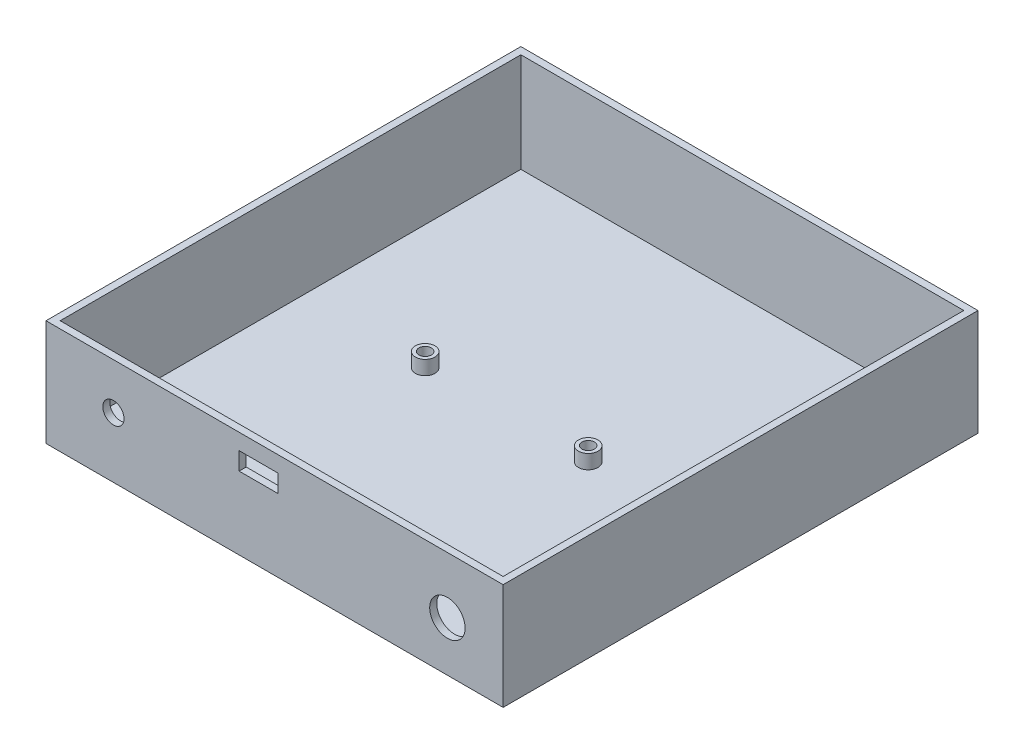
ISO-10303-21;
HEADER;
FILE_DESCRIPTION(('STEP AP214'),'2;1');
FILE_NAME('part.step','',(''),(''),'','','');
FILE_SCHEMA(('AUTOMOTIVE_DESIGN { 1 0 10303 214 1 1 1 1 }'));
ENDSEC;
DATA;
#1=APPLICATION_CONTEXT('core data for automotive mechanical design processes');
#2=APPLICATION_PROTOCOL_DEFINITION('international standard','automotive_design',2000,#1);
#3=PRODUCT_CONTEXT('',#1,'mechanical');
#4=PRODUCT('Part','Part','',(#3));
#5=PRODUCT_RELATED_PRODUCT_CATEGORY('part','',(#4));
#6=PRODUCT_DEFINITION_FORMATION('','',#4);
#7=PRODUCT_DEFINITION_CONTEXT('part definition',#1,'design');
#8=PRODUCT_DEFINITION('design','',#6,#7);
#9=PRODUCT_DEFINITION_SHAPE('','',#8);
#10=(LENGTH_UNIT() NAMED_UNIT(*) SI_UNIT(.MILLI.,.METRE.));
#11=(NAMED_UNIT(*) PLANE_ANGLE_UNIT() SI_UNIT($,.RADIAN.));
#12=(NAMED_UNIT(*) SI_UNIT($,.STERADIAN.) SOLID_ANGLE_UNIT());
#13=UNCERTAINTY_MEASURE_WITH_UNIT(LENGTH_MEASURE(1.E-05),#10,'distance_accuracy_value','');
#14=(GEOMETRIC_REPRESENTATION_CONTEXT(3) GLOBAL_UNCERTAINTY_ASSIGNED_CONTEXT((#13)) GLOBAL_UNIT_ASSIGNED_CONTEXT((#10,
#11,#12)) REPRESENTATION_CONTEXT('',''));
#15=CARTESIAN_POINT('',(0.,0.,0.));
#16=DIRECTION('',(0.,0.,1.));
#17=DIRECTION('',(1.,0.,0.));
#18=AXIS2_PLACEMENT_3D('',#15,#16,#17);
#19=CARTESIAN_POINT('',(125.,30.,0.));
#20=DIRECTION('',(0.,0.,1.));
#21=DIRECTION('',(1.,0.,0.));
#22=AXIS2_PLACEMENT_3D('',#19,#20,#21);
#23=PLANE('',#22);
#24=CARTESIAN_POINT('',(17.0245167625875,17.0325814726198,0.));
#25=DIRECTION('',(0.,0.,-1.));
#26=DIRECTION('',(-1.,0.,0.));
#27=AXIS2_PLACEMENT_3D('',#24,#25,#26);
#28=CIRCLE('',#27,3.);
#29=CARTESIAN_POINT('',(14.0245167625875,17.0325814726198,0.));
#30=VERTEX_POINT('',#29);
#31=EDGE_CURVE('E307',#30,#30,#28,.T.);
#32=ORIENTED_EDGE('',*,*,#31,.F.);
#33=EDGE_LOOP('',(#32));
#34=FACE_BOUND('',#33,.T.);
#35=CARTESIAN_POINT('',(111.272952746564,14.0325814726198,0.));
#36=DIRECTION('',(0.,0.,-1.));
#37=DIRECTION('',(-1.,0.,0.));
#38=AXIS2_PLACEMENT_3D('',#35,#36,#37);
#39=CIRCLE('',#38,5.);
#40=CARTESIAN_POINT('',(106.272952746564,14.0325814726198,0.));
#41=VERTEX_POINT('',#40);
#42=EDGE_CURVE('E312',#41,#41,#39,.T.);
#43=ORIENTED_EDGE('',*,*,#42,.F.);
#44=EDGE_LOOP('',(#43));
#45=FACE_BOUND('',#44,.T.);
#46=DIRECTION('',(0.,-1.,0.));
#47=VECTOR('',#46,1.);
#48=CARTESIAN_POINT('',(63.5,25.5,0.));
#49=LINE('',#48,#47);
#50=CARTESIAN_POINT('',(63.5,25.5,0.));
#51=VERTEX_POINT('',#50);
#52=CARTESIAN_POINT('',(63.5,20.5,0.));
#53=VERTEX_POINT('',#52);
#54=EDGE_CURVE('E51',#51,#53,#49,.T.);
#55=ORIENTED_EDGE('',*,*,#54,.F.);
#56=DIRECTION('',(-1.,0.,0.));
#57=VECTOR('',#56,1.);
#58=CARTESIAN_POINT('',(52.5,25.5,0.));
#59=LINE('',#58,#57);
#60=CARTESIAN_POINT('',(52.5,25.5,0.));
#61=VERTEX_POINT('',#60);
#62=EDGE_CURVE('E320',#51,#61,#59,.T.);
#63=ORIENTED_EDGE('',*,*,#62,.T.);
#64=DIRECTION('',(0.,-1.,0.));
#65=VECTOR('',#64,1.);
#66=CARTESIAN_POINT('',(52.5,25.5,0.));
#67=LINE('',#66,#65);
#68=CARTESIAN_POINT('',(52.5,20.5,0.));
#69=VERTEX_POINT('',#68);
#70=EDGE_CURVE('E167',#61,#69,#67,.T.);
#71=ORIENTED_EDGE('',*,*,#70,.T.);
#72=DIRECTION('',(-1.,0.,0.));
#73=VECTOR('',#72,1.);
#74=CARTESIAN_POINT('',(52.5,20.5,0.));
#75=LINE('',#74,#73);
#76=EDGE_CURVE('E168',#53,#69,#75,.T.);
#77=ORIENTED_EDGE('',*,*,#76,.F.);
#78=EDGE_LOOP('',(#55,#63,#71,#77));
#79=FACE_BOUND('',#78,.T.);
#80=DIRECTION('',(0.,-1.,0.));
#81=VECTOR('',#80,1.);
#82=CARTESIAN_POINT('',(33.1125413911823,6.,0.));
#83=LINE('',#82,#81);
#84=CARTESIAN_POINT('',(33.1125413911823,2.,0.));
#85=VERTEX_POINT('',#84);
#86=CARTESIAN_POINT('',(33.1125413911823,6.,0.));
#87=VERTEX_POINT('',#86);
#88=EDGE_CURVE('E208',#85,#87,#83,.F.);
#89=ORIENTED_EDGE('',*,*,#88,.F.);
#90=DIRECTION('',(1.,0.,0.));
#91=VECTOR('',#90,1.);
#92=CARTESIAN_POINT('',(0.,2.,0.));
#93=LINE('',#92,#91);
#94=CARTESIAN_POINT('',(0.,2.,0.));
#95=VERTEX_POINT('',#94);
#96=EDGE_CURVE('E281',#95,#85,#93,.T.);
#97=ORIENTED_EDGE('',*,*,#96,.F.);
#98=DIRECTION('',(0.,-1.,0.));
#99=VECTOR('',#98,1.);
#100=CARTESIAN_POINT('',(0.,30.,0.));
#101=LINE('',#100,#99);
#102=CARTESIAN_POINT('',(0.,30.,0.));
#103=VERTEX_POINT('',#102);
#104=EDGE_CURVE('E234',#103,#95,#101,.T.);
#105=ORIENTED_EDGE('',*,*,#104,.F.);
#106=DIRECTION('',(-1.,0.,0.));
#107=VECTOR('',#106,1.);
#108=CARTESIAN_POINT('',(125.,30.,0.));
#109=LINE('',#108,#107);
#110=CARTESIAN_POINT('',(125.,30.,0.));
#111=VERTEX_POINT('',#110);
#112=EDGE_CURVE('E222',#111,#103,#109,.T.);
#113=ORIENTED_EDGE('',*,*,#112,.F.);
#114=DIRECTION('',(0.,-1.,0.));
#115=VECTOR('',#114,1.);
#116=CARTESIAN_POINT('',(125.,30.,0.));
#117=LINE('',#116,#115);
#118=CARTESIAN_POINT('',(125.,2.,0.));
#119=VERTEX_POINT('',#118);
#120=EDGE_CURVE('E235',#111,#119,#117,.T.);
#121=ORIENTED_EDGE('',*,*,#120,.T.);
#122=CARTESIAN_POINT('',(82.8874586088177,2.,0.));
#123=VERTEX_POINT('',#122);
#124=EDGE_CURVE('E280',#123,#119,#93,.T.);
#125=ORIENTED_EDGE('',*,*,#124,.F.);
#126=DIRECTION('',(0.,-1.,0.));
#127=VECTOR('',#126,1.);
#128=CARTESIAN_POINT('',(82.8874586088177,6.,0.));
#129=LINE('',#128,#127);
#130=CARTESIAN_POINT('',(82.8874586088177,6.,0.));
#131=VERTEX_POINT('',#130);
#132=EDGE_CURVE('E299',#131,#123,#129,.T.);
#133=ORIENTED_EDGE('',*,*,#132,.F.);
#134=DIRECTION('',(-1.,0.,0.));
#135=VECTOR('',#134,1.);
#136=CARTESIAN_POINT('',(125.,6.,0.));
#137=LINE('',#136,#135);
#138=CARTESIAN_POINT('',(79.1125413911823,6.,0.));
#139=VERTEX_POINT('',#138);
#140=EDGE_CURVE('E296',#131,#139,#137,.T.);
#141=ORIENTED_EDGE('',*,*,#140,.T.);
#142=DIRECTION('',(0.,-1.,0.));
#143=VECTOR('',#142,1.);
#144=CARTESIAN_POINT('',(79.1125413911823,6.,0.));
#145=LINE('',#144,#143);
#146=CARTESIAN_POINT('',(79.1125413911823,2.,0.));
#147=VERTEX_POINT('',#146);
#148=EDGE_CURVE('E301',#147,#139,#145,.F.);
#149=ORIENTED_EDGE('',*,*,#148,.F.);
#150=CARTESIAN_POINT('',(36.8874586088177,2.,0.));
#151=VERTEX_POINT('',#150);
#152=EDGE_CURVE('E284',#151,#147,#93,.T.);
#153=ORIENTED_EDGE('',*,*,#152,.F.);
#154=DIRECTION('',(0.,-1.,0.));
#155=VECTOR('',#154,1.);
#156=CARTESIAN_POINT('',(36.8874586088177,6.,0.));
#157=LINE('',#156,#155);
#158=CARTESIAN_POINT('',(36.8874586088177,6.,0.));
#159=VERTEX_POINT('',#158);
#160=EDGE_CURVE('E205',#159,#151,#157,.T.);
#161=ORIENTED_EDGE('',*,*,#160,.F.);
#162=DIRECTION('',(1.,0.,0.));
#163=VECTOR('',#162,1.);
#164=CARTESIAN_POINT('',(125.,6.,0.));
#165=LINE('',#164,#163);
#166=EDGE_CURVE('E11',#87,#159,#165,.T.);
#167=ORIENTED_EDGE('',*,*,#166,.F.);
#168=EDGE_LOOP('',(#89,#97,#105,#113,#121,#125,#133,#141,#149,#153,#161,#167));
#169=FACE_BOUND('',#168,.T.);
#170=ADVANCED_FACE('F34',(#34,#45,#79,#169),#23,.F.);
#171=CARTESIAN_POINT('',(0.,2.,0.));
#172=DIRECTION('',(0.,-1.,0.));
#173=DIRECTION('',(0.,0.,-1.));
#174=AXIS2_PLACEMENT_3D('',#171,#172,#173);
#175=PLANE('',#174);
#176=CARTESIAN_POINT('',(35.,2.,-2.));
#177=DIRECTION('',(0.,-1.,0.));
#178=DIRECTION('',(0.,0.,-1.));
#179=AXIS2_PLACEMENT_3D('',#176,#177,#178);
#180=CIRCLE('',#179,2.75);
#181=EDGE_CURVE('E43',#151,#85,#180,.F.);
#182=ORIENTED_EDGE('',*,*,#181,.F.);
#183=ORIENTED_EDGE('',*,*,#152,.T.);
#184=CARTESIAN_POINT('',(81.,2.,-1.99999999999997));
#185=DIRECTION('',(0.,1.,0.));
#186=DIRECTION('',(0.,0.,1.));
#187=AXIS2_PLACEMENT_3D('',#184,#185,#186);
#188=CIRCLE('',#187,2.75);
#189=EDGE_CURVE('E211',#123,#147,#188,.T.);
#190=ORIENTED_EDGE('',*,*,#189,.F.);
#191=ORIENTED_EDGE('',*,*,#124,.T.);
#192=DIRECTION('',(0.,0.,-1.));
#193=VECTOR('',#192,1.);
#194=CARTESIAN_POINT('',(125.,2.,0.));
#195=LINE('',#194,#193);
#196=CARTESIAN_POINT('',(125.,2.,-130.));
#197=VERTEX_POINT('',#196);
#198=EDGE_CURVE('E283',#119,#197,#195,.T.);
#199=ORIENTED_EDGE('',*,*,#198,.T.);
#200=DIRECTION('',(-1.,0.,0.));
#201=VECTOR('',#200,1.);
#202=CARTESIAN_POINT('',(0.,2.,-130.));
#203=LINE('',#202,#201);
#204=CARTESIAN_POINT('',(0.,2.,-130.));
#205=VERTEX_POINT('',#204);
#206=EDGE_CURVE('E287',#197,#205,#203,.T.);
#207=ORIENTED_EDGE('',*,*,#206,.T.);
#208=DIRECTION('',(0.,0.,1.));
#209=VECTOR('',#208,1.);
#210=CARTESIAN_POINT('',(0.,2.,0.));
#211=LINE('',#210,#209);
#212=EDGE_CURVE('E272',#205,#95,#211,.T.);
#213=ORIENTED_EDGE('',*,*,#212,.T.);
#214=ORIENTED_EDGE('',*,*,#96,.T.);
#215=EDGE_LOOP('',(#182,#183,#190,#191,#199,#207,#213,#214));
#216=FACE_BOUND('',#215,.T.);
#217=CARTESIAN_POINT('',(81.,2.,-68.));
#218=DIRECTION('',(0.,-1.,0.));
#219=DIRECTION('',(0.,0.,-1.));
#220=AXIS2_PLACEMENT_3D('',#217,#218,#219);
#221=CIRCLE('',#220,2.75);
#222=CARTESIAN_POINT('',(81.,2.,-70.75));
#223=VERTEX_POINT('',#222);
#224=EDGE_CURVE('E293',#223,#223,#221,.F.);
#225=ORIENTED_EDGE('',*,*,#224,.F.);
#226=EDGE_LOOP('',(#225));
#227=FACE_BOUND('',#226,.T.);
#228=CARTESIAN_POINT('',(35.,2.,-68.));
#229=DIRECTION('',(0.,-1.,0.));
#230=DIRECTION('',(0.,0.,-1.));
#231=AXIS2_PLACEMENT_3D('',#228,#229,#230);
#232=CIRCLE('',#231,2.75);
#233=CARTESIAN_POINT('',(35.,2.,-70.75));
#234=VERTEX_POINT('',#233);
#235=EDGE_CURVE('E290',#234,#234,#232,.F.);
#236=ORIENTED_EDGE('',*,*,#235,.F.);
#237=EDGE_LOOP('',(#236));
#238=FACE_BOUND('',#237,.T.);
#239=ADVANCED_FACE('F343',(#216,#227,#238),#175,.F.);
#240=CARTESIAN_POINT('',(125.,30.,-130.));
#241=DIRECTION('',(1.,0.,0.));
#242=DIRECTION('',(0.,0.,-1.));
#243=AXIS2_PLACEMENT_3D('',#240,#241,#242);
#244=PLANE('',#243);
#245=DIRECTION('',(0.,-1.,0.));
#246=VECTOR('',#245,1.);
#247=CARTESIAN_POINT('',(125.,30.,-130.));
#248=LINE('',#247,#246);
#249=CARTESIAN_POINT('',(125.,30.,-130.));
#250=VERTEX_POINT('',#249);
#251=EDGE_CURVE('E239',#250,#197,#248,.T.);
#252=ORIENTED_EDGE('',*,*,#251,.T.);
#253=ORIENTED_EDGE('',*,*,#198,.F.);
#254=ORIENTED_EDGE('',*,*,#120,.F.);
#255=DIRECTION('',(0.,0.,1.));
#256=VECTOR('',#255,1.);
#257=CARTESIAN_POINT('',(125.,30.,-130.));
#258=LINE('',#257,#256);
#259=EDGE_CURVE('E231',#250,#111,#258,.T.);
#260=ORIENTED_EDGE('',*,*,#259,.F.);
#261=EDGE_LOOP('',(#252,#253,#254,#260));
#262=FACE_BOUND('',#261,.T.);
#263=ADVANCED_FACE('F349',(#262),#244,.F.);
#264=CARTESIAN_POINT('',(0.,30.,-130.));
#265=DIRECTION('',(0.,0.,-1.));
#266=DIRECTION('',(-1.,0.,0.));
#267=AXIS2_PLACEMENT_3D('',#264,#265,#266);
#268=PLANE('',#267);
#269=DIRECTION('',(0.,-1.,0.));
#270=VECTOR('',#269,1.);
#271=CARTESIAN_POINT('',(0.,30.,-130.));
#272=LINE('',#271,#270);
#273=CARTESIAN_POINT('',(0.,30.,-130.));
#274=VERTEX_POINT('',#273);
#275=EDGE_CURVE('E242',#274,#205,#272,.T.);
#276=ORIENTED_EDGE('',*,*,#275,.T.);
#277=ORIENTED_EDGE('',*,*,#206,.F.);
#278=ORIENTED_EDGE('',*,*,#251,.F.);
#279=DIRECTION('',(1.,0.,0.));
#280=VECTOR('',#279,1.);
#281=CARTESIAN_POINT('',(0.,30.,-130.));
#282=LINE('',#281,#280);
#283=EDGE_CURVE('E228',#274,#250,#282,.T.);
#284=ORIENTED_EDGE('',*,*,#283,.F.);
#285=EDGE_LOOP('',(#276,#277,#278,#284));
#286=FACE_BOUND('',#285,.T.);
#287=ADVANCED_FACE('F377',(#286),#268,.F.);
#288=CARTESIAN_POINT('',(0.,30.,0.));
#289=DIRECTION('',(-1.,0.,0.));
#290=DIRECTION('',(0.,0.,1.));
#291=AXIS2_PLACEMENT_3D('',#288,#289,#290);
#292=PLANE('',#291);
#293=ORIENTED_EDGE('',*,*,#104,.T.);
#294=ORIENTED_EDGE('',*,*,#212,.F.);
#295=ORIENTED_EDGE('',*,*,#275,.F.);
#296=DIRECTION('',(0.,0.,-1.));
#297=VECTOR('',#296,1.);
#298=CARTESIAN_POINT('',(0.,30.,0.));
#299=LINE('',#298,#297);
#300=EDGE_CURVE('E225',#103,#274,#299,.T.);
#301=ORIENTED_EDGE('',*,*,#300,.F.);
#302=EDGE_LOOP('',(#293,#294,#295,#301));
#303=FACE_BOUND('',#302,.T.);
#304=ADVANCED_FACE('F354',(#303),#292,.F.);
#305=CARTESIAN_POINT('',(127.,30.,2.));
#306=DIRECTION('',(0.,0.,1.));
#307=DIRECTION('',(1.,0.,0.));
#308=AXIS2_PLACEMENT_3D('',#305,#306,#307);
#309=PLANE('',#308);
#310=CARTESIAN_POINT('',(17.0245167625875,17.0325814726198,2.));
#311=DIRECTION('',(0.,0.,1.));
#312=DIRECTION('',(1.,0.,0.));
#313=AXIS2_PLACEMENT_3D('',#310,#311,#312);
#314=CIRCLE('',#313,3.);
#315=CARTESIAN_POINT('',(20.0245167625875,17.0325814726198,2.));
#316=VERTEX_POINT('',#315);
#317=EDGE_CURVE('E38',#316,#316,#314,.T.);
#318=ORIENTED_EDGE('',*,*,#317,.F.);
#319=EDGE_LOOP('',(#318));
#320=FACE_BOUND('',#319,.T.);
#321=CARTESIAN_POINT('',(111.272952746564,14.0325814726198,2.));
#322=DIRECTION('',(0.,0.,1.));
#323=DIRECTION('',(1.,0.,0.));
#324=AXIS2_PLACEMENT_3D('',#321,#322,#323);
#325=CIRCLE('',#324,5.);
#326=CARTESIAN_POINT('',(116.272952746564,14.0325814726198,2.));
#327=VERTEX_POINT('',#326);
#328=EDGE_CURVE('E305',#327,#327,#325,.T.);
#329=ORIENTED_EDGE('',*,*,#328,.F.);
#330=EDGE_LOOP('',(#329));
#331=FACE_BOUND('',#330,.T.);
#332=DIRECTION('',(1.,0.,0.));
#333=VECTOR('',#332,1.);
#334=CARTESIAN_POINT('',(52.5,25.5,2.));
#335=LINE('',#334,#333);
#336=CARTESIAN_POINT('',(52.5,25.5,2.));
#337=VERTEX_POINT('',#336);
#338=CARTESIAN_POINT('',(63.5,25.5,2.));
#339=VERTEX_POINT('',#338);
#340=EDGE_CURVE('E151',#337,#339,#335,.T.);
#341=ORIENTED_EDGE('',*,*,#340,.T.);
#342=DIRECTION('',(0.,-1.,0.));
#343=VECTOR('',#342,1.);
#344=CARTESIAN_POINT('',(63.5,25.5,2.));
#345=LINE('',#344,#343);
#346=CARTESIAN_POINT('',(63.5,20.5,2.));
#347=VERTEX_POINT('',#346);
#348=EDGE_CURVE('E174',#339,#347,#345,.T.);
#349=ORIENTED_EDGE('',*,*,#348,.T.);
#350=DIRECTION('',(1.,0.,0.));
#351=VECTOR('',#350,1.);
#352=CARTESIAN_POINT('',(52.5,20.5,2.));
#353=LINE('',#352,#351);
#354=CARTESIAN_POINT('',(52.5,20.5,2.));
#355=VERTEX_POINT('',#354);
#356=EDGE_CURVE('E172',#355,#347,#353,.T.);
#357=ORIENTED_EDGE('',*,*,#356,.F.);
#358=DIRECTION('',(0.,-1.,0.));
#359=VECTOR('',#358,1.);
#360=CARTESIAN_POINT('',(52.5,25.5,2.));
#361=LINE('',#360,#359);
#362=EDGE_CURVE('E164',#337,#355,#361,.T.);
#363=ORIENTED_EDGE('',*,*,#362,.F.);
#364=EDGE_LOOP('',(#341,#349,#357,#363));
#365=FACE_BOUND('',#364,.T.);
#366=DIRECTION('',(-1.,0.,0.));
#367=VECTOR('',#366,1.);
#368=CARTESIAN_POINT('',(127.,0.,2.));
#369=LINE('',#368,#367);
#370=CARTESIAN_POINT('',(127.,0.,2.));
#371=VERTEX_POINT('',#370);
#372=CARTESIAN_POINT('',(-2.,0.,2.));
#373=VERTEX_POINT('',#372);
#374=EDGE_CURVE('E238',#371,#373,#369,.T.);
#375=ORIENTED_EDGE('',*,*,#374,.F.);
#376=DIRECTION('',(0.,-1.,0.));
#377=VECTOR('',#376,1.);
#378=CARTESIAN_POINT('',(127.,30.,2.));
#379=LINE('',#378,#377);
#380=CARTESIAN_POINT('',(127.,30.,2.));
#381=VERTEX_POINT('',#380);
#382=EDGE_CURVE('E270',#381,#371,#379,.T.);
#383=ORIENTED_EDGE('',*,*,#382,.F.);
#384=DIRECTION('',(-1.,0.,0.));
#385=VECTOR('',#384,1.);
#386=CARTESIAN_POINT('',(127.,30.,2.));
#387=LINE('',#386,#385);
#388=CARTESIAN_POINT('',(-2.,30.,2.));
#389=VERTEX_POINT('',#388);
#390=EDGE_CURVE('E246',#381,#389,#387,.T.);
#391=ORIENTED_EDGE('',*,*,#390,.T.);
#392=DIRECTION('',(0.,-1.,0.));
#393=VECTOR('',#392,1.);
#394=CARTESIAN_POINT('',(-2.,30.,2.));
#395=LINE('',#394,#393);
#396=EDGE_CURVE('E259',#389,#373,#395,.T.);
#397=ORIENTED_EDGE('',*,*,#396,.T.);
#398=EDGE_LOOP('',(#375,#383,#391,#397));
#399=FACE_BOUND('',#398,.T.);
#400=ADVANCED_FACE('F170',(#320,#331,#365,#399),#309,.T.);
#401=CARTESIAN_POINT('',(127.,30.,-132.));
#402=DIRECTION('',(1.,0.,0.));
#403=DIRECTION('',(0.,0.,-1.));
#404=AXIS2_PLACEMENT_3D('',#401,#402,#403);
#405=PLANE('',#404);
#406=DIRECTION('',(0.,0.,1.));
#407=VECTOR('',#406,1.);
#408=CARTESIAN_POINT('',(127.,0.,-132.));
#409=LINE('',#408,#407);
#410=CARTESIAN_POINT('',(127.,0.,-132.));
#411=VERTEX_POINT('',#410);
#412=EDGE_CURVE('E250',#411,#371,#409,.T.);
#413=ORIENTED_EDGE('',*,*,#412,.F.);
#414=DIRECTION('',(0.,-1.,0.));
#415=VECTOR('',#414,1.);
#416=CARTESIAN_POINT('',(127.,30.,-132.));
#417=LINE('',#416,#415);
#418=CARTESIAN_POINT('',(127.,30.,-132.));
#419=VERTEX_POINT('',#418);
#420=EDGE_CURVE('E273',#419,#411,#417,.T.);
#421=ORIENTED_EDGE('',*,*,#420,.F.);
#422=DIRECTION('',(0.,0.,1.));
#423=VECTOR('',#422,1.);
#424=CARTESIAN_POINT('',(127.,30.,-132.));
#425=LINE('',#424,#423);
#426=EDGE_CURVE('E256',#419,#381,#425,.T.);
#427=ORIENTED_EDGE('',*,*,#426,.T.);
#428=ORIENTED_EDGE('',*,*,#382,.T.);
#429=EDGE_LOOP('',(#413,#421,#427,#428));
#430=FACE_BOUND('',#429,.T.);
#431=ADVANCED_FACE('F361',(#430),#405,.T.);
#432=CARTESIAN_POINT('',(-2.,30.,-132.));
#433=DIRECTION('',(0.,0.,-1.));
#434=DIRECTION('',(-1.,0.,0.));
#435=AXIS2_PLACEMENT_3D('',#432,#433,#434);
#436=PLANE('',#435);
#437=DIRECTION('',(1.,0.,0.));
#438=VECTOR('',#437,1.);
#439=CARTESIAN_POINT('',(-2.,0.,-132.));
#440=LINE('',#439,#438);
#441=CARTESIAN_POINT('',(-2.,0.,-132.));
#442=VERTEX_POINT('',#441);
#443=EDGE_CURVE('E265',#442,#411,#440,.T.);
#444=ORIENTED_EDGE('',*,*,#443,.F.);
#445=DIRECTION('',(0.,-1.,0.));
#446=VECTOR('',#445,1.);
#447=CARTESIAN_POINT('',(-2.,30.,-132.));
#448=LINE('',#447,#446);
#449=CARTESIAN_POINT('',(-2.,30.,-132.));
#450=VERTEX_POINT('',#449);
#451=EDGE_CURVE('E275',#450,#442,#448,.T.);
#452=ORIENTED_EDGE('',*,*,#451,.F.);
#453=DIRECTION('',(1.,0.,0.));
#454=VECTOR('',#453,1.);
#455=CARTESIAN_POINT('',(-2.,30.,-132.));
#456=LINE('',#455,#454);
#457=EDGE_CURVE('E253',#450,#419,#456,.T.);
#458=ORIENTED_EDGE('',*,*,#457,.T.);
#459=ORIENTED_EDGE('',*,*,#420,.T.);
#460=EDGE_LOOP('',(#444,#452,#458,#459));
#461=FACE_BOUND('',#460,.T.);
#462=ADVANCED_FACE('F364',(#461),#436,.T.);
#463=CARTESIAN_POINT('',(-2.,30.,2.));
#464=DIRECTION('',(-1.,0.,0.));
#465=DIRECTION('',(0.,0.,1.));
#466=AXIS2_PLACEMENT_3D('',#463,#464,#465);
#467=PLANE('',#466);
#468=DIRECTION('',(0.,0.,-1.));
#469=VECTOR('',#468,1.);
#470=CARTESIAN_POINT('',(-2.,0.,2.));
#471=LINE('',#470,#469);
#472=EDGE_CURVE('E262',#373,#442,#471,.T.);
#473=ORIENTED_EDGE('',*,*,#472,.F.);
#474=ORIENTED_EDGE('',*,*,#396,.F.);
#475=DIRECTION('',(0.,0.,-1.));
#476=VECTOR('',#475,1.);
#477=CARTESIAN_POINT('',(-2.,30.,2.));
#478=LINE('',#477,#476);
#479=EDGE_CURVE('E249',#389,#450,#478,.T.);
#480=ORIENTED_EDGE('',*,*,#479,.T.);
#481=ORIENTED_EDGE('',*,*,#451,.T.);
#482=EDGE_LOOP('',(#473,#474,#480,#481));
#483=FACE_BOUND('',#482,.T.);
#484=ADVANCED_FACE('F359',(#483),#467,.T.);
#485=CARTESIAN_POINT('',(0.,30.,0.));
#486=DIRECTION('',(0.,-1.,0.));
#487=DIRECTION('',(0.,0.,-1.));
#488=AXIS2_PLACEMENT_3D('',#485,#486,#487);
#489=PLANE('',#488);
#490=ORIENTED_EDGE('',*,*,#259,.T.);
#491=ORIENTED_EDGE('',*,*,#112,.T.);
#492=ORIENTED_EDGE('',*,*,#300,.T.);
#493=ORIENTED_EDGE('',*,*,#283,.T.);
#494=EDGE_LOOP('',(#490,#491,#492,#493));
#495=FACE_BOUND('',#494,.T.);
#496=ORIENTED_EDGE('',*,*,#390,.F.);
#497=ORIENTED_EDGE('',*,*,#426,.F.);
#498=ORIENTED_EDGE('',*,*,#457,.F.);
#499=ORIENTED_EDGE('',*,*,#479,.F.);
#500=EDGE_LOOP('',(#496,#497,#498,#499));
#501=FACE_BOUND('',#500,.T.);
#502=ADVANCED_FACE('F356',(#495,#501),#489,.F.);
#503=CARTESIAN_POINT('',(0.,0.,0.));
#504=DIRECTION('',(0.,-1.,0.));
#505=DIRECTION('',(0.,0.,-1.));
#506=AXIS2_PLACEMENT_3D('',#503,#504,#505);
#507=PLANE('',#506);
#508=ORIENTED_EDGE('',*,*,#374,.T.);
#509=ORIENTED_EDGE('',*,*,#472,.T.);
#510=ORIENTED_EDGE('',*,*,#443,.T.);
#511=ORIENTED_EDGE('',*,*,#412,.T.);
#512=EDGE_LOOP('',(#508,#509,#510,#511));
#513=FACE_BOUND('',#512,.T.);
#514=ADVANCED_FACE('F36',(#513),#507,.T.);
#515=CARTESIAN_POINT('',(35.,6.,-68.));
#516=DIRECTION('',(0.,-1.,0.));
#517=DIRECTION('',(0.,0.,-1.));
#518=AXIS2_PLACEMENT_3D('',#515,#516,#517);
#519=CYLINDRICAL_SURFACE('',#518,2.75);
#520=CARTESIAN_POINT('',(35.,6.,-68.));
#521=DIRECTION('',(0.,1.,0.));
#522=DIRECTION('',(0.,0.,1.));
#523=AXIS2_PLACEMENT_3D('',#520,#521,#522);
#524=CIRCLE('',#523,2.75);
#525=CARTESIAN_POINT('',(35.,6.,-65.25));
#526=VERTEX_POINT('',#525);
#527=EDGE_CURVE('E219',#526,#526,#524,.T.);
#528=ORIENTED_EDGE('',*,*,#527,.F.);
#529=EDGE_LOOP('',(#528));
#530=FACE_BOUND('',#529,.T.);
#531=ORIENTED_EDGE('',*,*,#235,.T.);
#532=EDGE_LOOP('',(#531));
#533=FACE_BOUND('',#532,.T.);
#534=ADVANCED_FACE('F424',(#530,#533),#519,.T.);
#535=CARTESIAN_POINT('',(35.,6.,-68.));
#536=DIRECTION('',(0.,1.,0.));
#537=DIRECTION('',(0.,0.,1.));
#538=AXIS2_PLACEMENT_3D('',#535,#536,#537);
#539=PLANE('',#538);
#540=CARTESIAN_POINT('',(35.,6.,-68.));
#541=DIRECTION('',(0.,1.,0.));
#542=DIRECTION('',(0.,0.,1.));
#543=AXIS2_PLACEMENT_3D('',#540,#541,#542);
#544=CIRCLE('',#543,1.75);
#545=CARTESIAN_POINT('',(35.,6.,-66.25));
#546=VERTEX_POINT('',#545);
#547=EDGE_CURVE('E192',#546,#546,#544,.T.);
#548=ORIENTED_EDGE('',*,*,#547,.F.);
#549=EDGE_LOOP('',(#548));
#550=FACE_BOUND('',#549,.T.);
#551=ORIENTED_EDGE('',*,*,#527,.T.);
#552=EDGE_LOOP('',(#551));
#553=FACE_BOUND('',#552,.T.);
#554=ADVANCED_FACE('F430',(#550,#553),#539,.T.);
#555=CARTESIAN_POINT('',(81.,6.,-68.));
#556=DIRECTION('',(0.,-1.,0.));
#557=DIRECTION('',(0.,0.,-1.));
#558=AXIS2_PLACEMENT_3D('',#555,#556,#557);
#559=CYLINDRICAL_SURFACE('',#558,2.75);
#560=CARTESIAN_POINT('',(81.,6.,-68.));
#561=DIRECTION('',(0.,1.,0.));
#562=DIRECTION('',(0.,0.,-1.));
#563=AXIS2_PLACEMENT_3D('',#560,#561,#562);
#564=CIRCLE('',#563,2.75);
#565=CARTESIAN_POINT('',(81.,6.,-70.75));
#566=VERTEX_POINT('',#565);
#567=EDGE_CURVE('E214',#566,#566,#564,.T.);
#568=ORIENTED_EDGE('',*,*,#567,.F.);
#569=EDGE_LOOP('',(#568));
#570=FACE_BOUND('',#569,.T.);
#571=ORIENTED_EDGE('',*,*,#224,.T.);
#572=EDGE_LOOP('',(#571));
#573=FACE_BOUND('',#572,.T.);
#574=ADVANCED_FACE('F441',(#570,#573),#559,.T.);
#575=CARTESIAN_POINT('',(81.,6.,-68.));
#576=DIRECTION('',(0.,-1.,0.));
#577=DIRECTION('',(0.,0.,-1.));
#578=AXIS2_PLACEMENT_3D('',#575,#576,#577);
#579=PLANE('',#578);
#580=CARTESIAN_POINT('',(81.,6.,-68.));
#581=DIRECTION('',(0.,1.,0.));
#582=DIRECTION('',(0.,0.,1.));
#583=AXIS2_PLACEMENT_3D('',#580,#581,#582);
#584=CIRCLE('',#583,1.75);
#585=CARTESIAN_POINT('',(81.,6.,-66.25));
#586=VERTEX_POINT('',#585);
#587=EDGE_CURVE('E173',#586,#586,#584,.T.);
#588=ORIENTED_EDGE('',*,*,#587,.F.);
#589=EDGE_LOOP('',(#588));
#590=FACE_BOUND('',#589,.T.);
#591=ORIENTED_EDGE('',*,*,#567,.T.);
#592=EDGE_LOOP('',(#591));
#593=FACE_BOUND('',#592,.T.);
#594=ADVANCED_FACE('F451',(#590,#593),#579,.F.);
#595=CARTESIAN_POINT('',(81.,6.,-1.99999999999997));
#596=DIRECTION('',(0.,-1.,0.));
#597=DIRECTION('',(0.,0.,-1.));
#598=AXIS2_PLACEMENT_3D('',#595,#596,#597);
#599=CYLINDRICAL_SURFACE('',#598,2.75);
#600=ORIENTED_EDGE('',*,*,#189,.T.);
#601=ORIENTED_EDGE('',*,*,#148,.T.);
#602=CARTESIAN_POINT('',(81.,6.,-1.99999999999997));
#603=DIRECTION('',(0.,1.,0.));
#604=DIRECTION('',(0.,0.,1.));
#605=AXIS2_PLACEMENT_3D('',#602,#603,#604);
#606=CIRCLE('',#605,2.75);
#607=EDGE_CURVE('E212',#131,#139,#606,.T.);
#608=ORIENTED_EDGE('',*,*,#607,.F.);
#609=ORIENTED_EDGE('',*,*,#132,.T.);
#610=EDGE_LOOP('',(#600,#601,#608,#609));
#611=FACE_BOUND('',#610,.T.);
#612=ADVANCED_FACE('F460',(#611),#599,.T.);
#613=CARTESIAN_POINT('',(81.,6.,-1.99999999999997));
#614=DIRECTION('',(0.,1.,0.));
#615=DIRECTION('',(0.,0.,1.));
#616=AXIS2_PLACEMENT_3D('',#613,#614,#615);
#617=PLANE('',#616);
#618=CARTESIAN_POINT('',(81.,6.,-1.99999999999997));
#619=DIRECTION('',(0.,1.,0.));
#620=DIRECTION('',(0.,0.,1.));
#621=AXIS2_PLACEMENT_3D('',#618,#619,#620);
#622=CIRCLE('',#621,1.75);
#623=CARTESIAN_POINT('',(81.,6.,-0.249999999999977));
#624=VERTEX_POINT('',#623);
#625=EDGE_CURVE('E185',#624,#624,#622,.T.);
#626=ORIENTED_EDGE('',*,*,#625,.F.);
#627=EDGE_LOOP('',(#626));
#628=FACE_BOUND('',#627,.T.);
#629=ORIENTED_EDGE('',*,*,#140,.F.);
#630=ORIENTED_EDGE('',*,*,#607,.T.);
#631=EDGE_LOOP('',(#629,#630));
#632=FACE_BOUND('',#631,.T.);
#633=ADVANCED_FACE('F469',(#628,#632),#617,.T.);
#634=CARTESIAN_POINT('',(35.,6.,-2.));
#635=DIRECTION('',(0.,-1.,0.));
#636=DIRECTION('',(0.,0.,-1.));
#637=AXIS2_PLACEMENT_3D('',#634,#635,#636);
#638=PLANE('',#637);
#639=CARTESIAN_POINT('',(35.,6.,-2.));
#640=DIRECTION('',(0.,1.,0.));
#641=DIRECTION('',(0.,0.,1.));
#642=AXIS2_PLACEMENT_3D('',#639,#640,#641);
#643=CIRCLE('',#642,1.75);
#644=CARTESIAN_POINT('',(35.,6.,-0.249999999999998));
#645=VERTEX_POINT('',#644);
#646=EDGE_CURVE('E186',#645,#645,#643,.T.);
#647=ORIENTED_EDGE('',*,*,#646,.F.);
#648=EDGE_LOOP('',(#647));
#649=FACE_BOUND('',#648,.T.);
#650=CARTESIAN_POINT('',(35.,6.,-2.));
#651=DIRECTION('',(0.,1.,0.));
#652=DIRECTION('',(0.,0.,-1.));
#653=AXIS2_PLACEMENT_3D('',#650,#651,#652);
#654=CIRCLE('',#653,2.75);
#655=EDGE_CURVE('E200',#159,#87,#654,.T.);
#656=ORIENTED_EDGE('',*,*,#655,.T.);
#657=ORIENTED_EDGE('',*,*,#166,.T.);
#658=EDGE_LOOP('',(#656,#657));
#659=FACE_BOUND('',#658,.T.);
#660=ADVANCED_FACE('F477',(#649,#659),#638,.F.);
#661=CARTESIAN_POINT('',(35.,6.,-2.));
#662=DIRECTION('',(0.,-1.,0.));
#663=DIRECTION('',(0.,0.,-1.));
#664=AXIS2_PLACEMENT_3D('',#661,#662,#663);
#665=CYLINDRICAL_SURFACE('',#664,2.75);
#666=ORIENTED_EDGE('',*,*,#181,.T.);
#667=ORIENTED_EDGE('',*,*,#88,.T.);
#668=ORIENTED_EDGE('',*,*,#655,.F.);
#669=ORIENTED_EDGE('',*,*,#160,.T.);
#670=EDGE_LOOP('',(#666,#667,#668,#669));
#671=FACE_BOUND('',#670,.T.);
#672=ADVANCED_FACE('F486',(#671),#665,.T.);
#673=CARTESIAN_POINT('',(35.,2.,-2.));
#674=DIRECTION('',(0.,1.,0.));
#675=DIRECTION('',(0.,0.,1.));
#676=AXIS2_PLACEMENT_3D('',#673,#674,#675);
#677=CYLINDRICAL_SURFACE('',#676,1.75);
#678=CARTESIAN_POINT('',(35.,2.,-2.));
#679=DIRECTION('',(0.,1.,0.));
#680=DIRECTION('',(0.,0.,1.));
#681=AXIS2_PLACEMENT_3D('',#678,#679,#680);
#682=CIRCLE('',#681,1.75);
#683=CARTESIAN_POINT('',(35.,2.,-0.249999999999998));
#684=VERTEX_POINT('',#683);
#685=EDGE_CURVE('E182',#684,#684,#682,.T.);
#686=ORIENTED_EDGE('',*,*,#685,.F.);
#687=EDGE_LOOP('',(#686));
#688=FACE_BOUND('',#687,.T.);
#689=ORIENTED_EDGE('',*,*,#646,.T.);
#690=EDGE_LOOP('',(#689));
#691=FACE_BOUND('',#690,.T.);
#692=ADVANCED_FACE('F495',(#688,#691),#677,.F.);
#693=CARTESIAN_POINT('',(35.,2.,-2.));
#694=DIRECTION('',(0.,1.,0.));
#695=DIRECTION('',(0.,0.,1.));
#696=AXIS2_PLACEMENT_3D('',#693,#694,#695);
#697=PLANE('',#696);
#698=ORIENTED_EDGE('',*,*,#685,.T.);
#699=EDGE_LOOP('',(#698));
#700=FACE_BOUND('',#699,.T.);
#701=ADVANCED_FACE('F503',(#700),#697,.T.);
#702=CARTESIAN_POINT('',(81.,2.,-1.99999999999997));
#703=DIRECTION('',(0.,1.,0.));
#704=DIRECTION('',(0.,0.,1.));
#705=AXIS2_PLACEMENT_3D('',#702,#703,#704);
#706=CYLINDRICAL_SURFACE('',#705,1.75);
#707=CARTESIAN_POINT('',(81.,2.,-1.99999999999997));
#708=DIRECTION('',(0.,1.,0.));
#709=DIRECTION('',(0.,0.,1.));
#710=AXIS2_PLACEMENT_3D('',#707,#708,#709);
#711=CIRCLE('',#710,1.75);
#712=CARTESIAN_POINT('',(81.,2.,-0.249999999999977));
#713=VERTEX_POINT('',#712);
#714=EDGE_CURVE('E197',#713,#713,#711,.T.);
#715=ORIENTED_EDGE('',*,*,#714,.F.);
#716=EDGE_LOOP('',(#715));
#717=FACE_BOUND('',#716,.T.);
#718=ORIENTED_EDGE('',*,*,#625,.T.);
#719=EDGE_LOOP('',(#718));
#720=FACE_BOUND('',#719,.T.);
#721=ADVANCED_FACE('F512',(#717,#720),#706,.F.);
#722=CARTESIAN_POINT('',(81.,2.,-1.99999999999997));
#723=DIRECTION('',(0.,1.,0.));
#724=DIRECTION('',(0.,0.,1.));
#725=AXIS2_PLACEMENT_3D('',#722,#723,#724);
#726=PLANE('',#725);
#727=ORIENTED_EDGE('',*,*,#714,.T.);
#728=EDGE_LOOP('',(#727));
#729=FACE_BOUND('',#728,.T.);
#730=ADVANCED_FACE('F521',(#729),#726,.T.);
#731=CARTESIAN_POINT('',(81.,2.,-68.));
#732=DIRECTION('',(0.,1.,0.));
#733=DIRECTION('',(0.,0.,1.));
#734=AXIS2_PLACEMENT_3D('',#731,#732,#733);
#735=CYLINDRICAL_SURFACE('',#734,1.75);
#736=CARTESIAN_POINT('',(81.,2.,-68.));
#737=DIRECTION('',(0.,1.,0.));
#738=DIRECTION('',(0.,0.,1.));
#739=AXIS2_PLACEMENT_3D('',#736,#737,#738);
#740=CIRCLE('',#739,1.75);
#741=CARTESIAN_POINT('',(81.,2.,-66.25));
#742=VERTEX_POINT('',#741);
#743=EDGE_CURVE('E177',#742,#742,#740,.T.);
#744=ORIENTED_EDGE('',*,*,#743,.F.);
#745=EDGE_LOOP('',(#744));
#746=FACE_BOUND('',#745,.T.);
#747=ORIENTED_EDGE('',*,*,#587,.T.);
#748=EDGE_LOOP('',(#747));
#749=FACE_BOUND('',#748,.T.);
#750=ADVANCED_FACE('F530',(#746,#749),#735,.F.);
#751=CARTESIAN_POINT('',(81.,2.,-68.));
#752=DIRECTION('',(0.,1.,0.));
#753=DIRECTION('',(0.,0.,1.));
#754=AXIS2_PLACEMENT_3D('',#751,#752,#753);
#755=PLANE('',#754);
#756=ORIENTED_EDGE('',*,*,#743,.T.);
#757=EDGE_LOOP('',(#756));
#758=FACE_BOUND('',#757,.T.);
#759=ADVANCED_FACE('F539',(#758),#755,.T.);
#760=CARTESIAN_POINT('',(35.,2.,-68.));
#761=DIRECTION('',(0.,1.,0.));
#762=DIRECTION('',(0.,0.,1.));
#763=AXIS2_PLACEMENT_3D('',#760,#761,#762);
#764=CYLINDRICAL_SURFACE('',#763,1.75);
#765=CARTESIAN_POINT('',(35.,2.,-68.));
#766=DIRECTION('',(0.,1.,0.));
#767=DIRECTION('',(0.,0.,1.));
#768=AXIS2_PLACEMENT_3D('',#765,#766,#767);
#769=CIRCLE('',#768,1.75);
#770=CARTESIAN_POINT('',(35.,2.,-66.25));
#771=VERTEX_POINT('',#770);
#772=EDGE_CURVE('E189',#771,#771,#769,.T.);
#773=ORIENTED_EDGE('',*,*,#772,.F.);
#774=EDGE_LOOP('',(#773));
#775=FACE_BOUND('',#774,.T.);
#776=ORIENTED_EDGE('',*,*,#547,.T.);
#777=EDGE_LOOP('',(#776));
#778=FACE_BOUND('',#777,.T.);
#779=ADVANCED_FACE('F548',(#775,#778),#764,.F.);
#780=CARTESIAN_POINT('',(35.,2.,-68.));
#781=DIRECTION('',(0.,1.,0.));
#782=DIRECTION('',(0.,0.,1.));
#783=AXIS2_PLACEMENT_3D('',#780,#781,#782);
#784=PLANE('',#783);
#785=ORIENTED_EDGE('',*,*,#772,.T.);
#786=EDGE_LOOP('',(#785));
#787=FACE_BOUND('',#786,.T.);
#788=ADVANCED_FACE('F339',(#787),#784,.T.);
#789=CARTESIAN_POINT('',(52.5,25.5,0.));
#790=DIRECTION('',(1.,0.,0.));
#791=DIRECTION('',(0.,0.,-1.));
#792=AXIS2_PLACEMENT_3D('',#789,#790,#791);
#793=PLANE('',#792);
#794=DIRECTION('',(0.,0.,1.));
#795=VECTOR('',#794,1.);
#796=CARTESIAN_POINT('',(52.5,20.5,0.));
#797=LINE('',#796,#795);
#798=EDGE_CURVE('E59',#69,#355,#797,.T.);
#799=ORIENTED_EDGE('',*,*,#798,.F.);
#800=ORIENTED_EDGE('',*,*,#70,.F.);
#801=DIRECTION('',(0.,0.,1.));
#802=VECTOR('',#801,1.);
#803=CARTESIAN_POINT('',(52.5,25.5,0.));
#804=LINE('',#803,#802);
#805=EDGE_CURVE('E155',#61,#337,#804,.T.);
#806=ORIENTED_EDGE('',*,*,#805,.T.);
#807=ORIENTED_EDGE('',*,*,#362,.T.);
#808=EDGE_LOOP('',(#799,#800,#806,#807));
#809=FACE_BOUND('',#808,.T.);
#810=ADVANCED_FACE('F163',(#809),#793,.T.);
#811=CARTESIAN_POINT('',(63.5,25.5,0.));
#812=DIRECTION('',(-1.,0.,0.));
#813=DIRECTION('',(0.,0.,1.));
#814=AXIS2_PLACEMENT_3D('',#811,#812,#813);
#815=PLANE('',#814);
#816=DIRECTION('',(0.,0.,-1.));
#817=VECTOR('',#816,1.);
#818=CARTESIAN_POINT('',(63.5,20.5,0.));
#819=LINE('',#818,#817);
#820=EDGE_CURVE('E324',#347,#53,#819,.T.);
#821=ORIENTED_EDGE('',*,*,#820,.F.);
#822=ORIENTED_EDGE('',*,*,#348,.F.);
#823=DIRECTION('',(0.,0.,-1.));
#824=VECTOR('',#823,1.);
#825=CARTESIAN_POINT('',(63.5,25.5,0.));
#826=LINE('',#825,#824);
#827=EDGE_CURVE('E157',#339,#51,#826,.T.);
#828=ORIENTED_EDGE('',*,*,#827,.T.);
#829=ORIENTED_EDGE('',*,*,#54,.T.);
#830=EDGE_LOOP('',(#821,#822,#828,#829));
#831=FACE_BOUND('',#830,.T.);
#832=ADVANCED_FACE('F331',(#831),#815,.T.);
#833=CARTESIAN_POINT('',(0.,25.5,0.));
#834=DIRECTION('',(0.,1.,0.));
#835=DIRECTION('',(0.,0.,1.));
#836=AXIS2_PLACEMENT_3D('',#833,#834,#835);
#837=PLANE('',#836);
#838=ORIENTED_EDGE('',*,*,#805,.F.);
#839=ORIENTED_EDGE('',*,*,#62,.F.);
#840=ORIENTED_EDGE('',*,*,#827,.F.);
#841=ORIENTED_EDGE('',*,*,#340,.F.);
#842=EDGE_LOOP('',(#838,#839,#840,#841));
#843=FACE_BOUND('',#842,.T.);
#844=ADVANCED_FACE('F153',(#843),#837,.F.);
#845=CARTESIAN_POINT('',(0.,20.5,0.));
#846=DIRECTION('',(0.,1.,0.));
#847=DIRECTION('',(0.,0.,1.));
#848=AXIS2_PLACEMENT_3D('',#845,#846,#847);
#849=PLANE('',#848);
#850=ORIENTED_EDGE('',*,*,#798,.T.);
#851=ORIENTED_EDGE('',*,*,#356,.T.);
#852=ORIENTED_EDGE('',*,*,#820,.T.);
#853=ORIENTED_EDGE('',*,*,#76,.T.);
#854=EDGE_LOOP('',(#850,#851,#852,#853));
#855=FACE_BOUND('',#854,.T.);
#856=ADVANCED_FACE('F330',(#855),#849,.T.);
#857=CARTESIAN_POINT('',(111.272952746564,14.0325814726198,5.));
#858=DIRECTION('',(0.,0.,-1.));
#859=DIRECTION('',(-1.,0.,0.));
#860=AXIS2_PLACEMENT_3D('',#857,#858,#859);
#861=CYLINDRICAL_SURFACE('',#860,5.);
#862=ORIENTED_EDGE('',*,*,#328,.T.);
#863=EDGE_LOOP('',(#862));
#864=FACE_BOUND('',#863,.T.);
#865=ORIENTED_EDGE('',*,*,#42,.T.);
#866=EDGE_LOOP('',(#865));
#867=FACE_BOUND('',#866,.T.);
#868=ADVANCED_FACE('F384',(#864,#867),#861,.F.);
#869=CARTESIAN_POINT('',(17.0245167625875,17.0325814726198,5.));
#870=DIRECTION('',(0.,0.,-1.));
#871=DIRECTION('',(-1.,0.,0.));
#872=AXIS2_PLACEMENT_3D('',#869,#870,#871);
#873=CYLINDRICAL_SURFACE('',#872,3.);
#874=ORIENTED_EDGE('',*,*,#317,.T.);
#875=EDGE_LOOP('',(#874));
#876=FACE_BOUND('',#875,.T.);
#877=ORIENTED_EDGE('',*,*,#31,.T.);
#878=EDGE_LOOP('',(#877));
#879=FACE_BOUND('',#878,.T.);
#880=ADVANCED_FACE('F382',(#876,#879),#873,.F.);
#881=CLOSED_SHELL('',(#170,#239,#263,#287,#304,#400,#431,#462,#484,#502,#514,#534,#554,#574,
#594,#612,#633,#660,#672,#692,#701,#721,#730,#750,#759,#779,#788,#810,#832,#844,#856,#868,#880));
#882=MANIFOLD_SOLID_BREP('B2',#881);
#883=ADVANCED_BREP_SHAPE_REPRESENTATION('',(#18,#882),#14);
#884=SHAPE_DEFINITION_REPRESENTATION(#9,#883);
ENDSEC;
END-ISO-10303-21;
